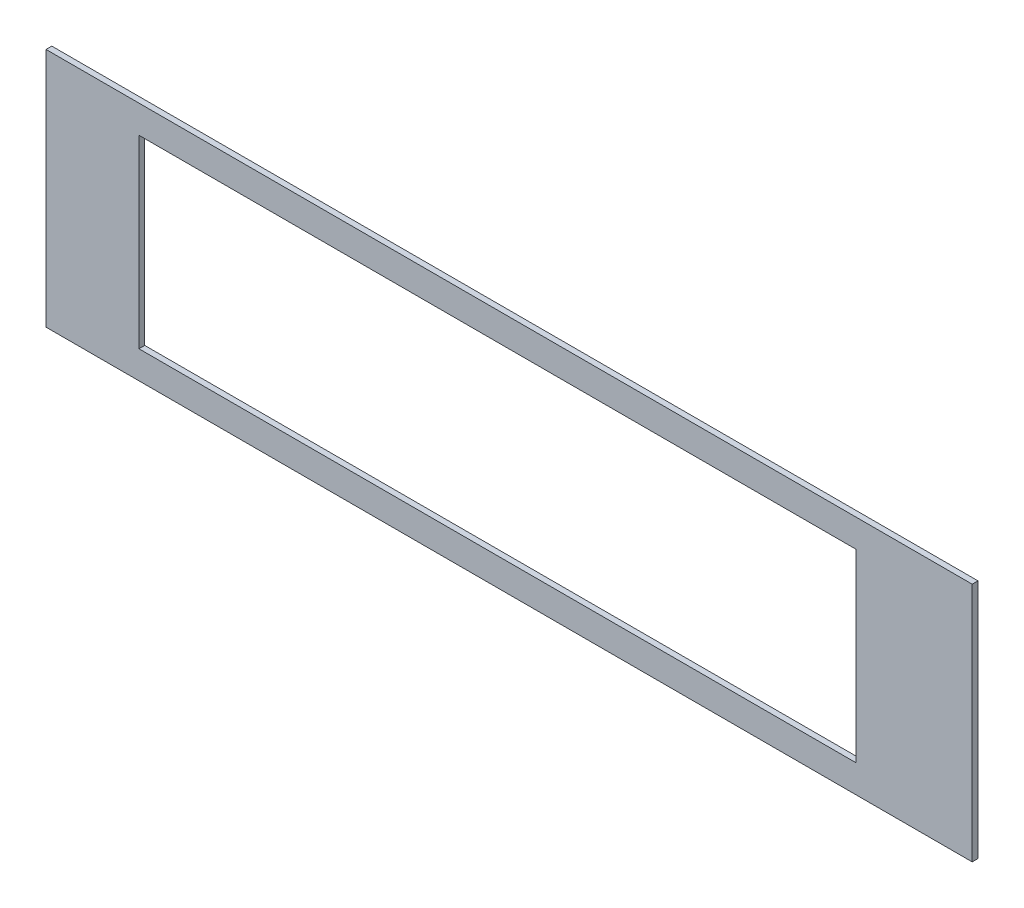
ISO-10303-21;
HEADER;
FILE_DESCRIPTION(('STEP AP214'),'2;1');
FILE_NAME('part.step','',(''),(''),'','','');
FILE_SCHEMA(('AUTOMOTIVE_DESIGN { 1 0 10303 214 1 1 1 1 }'));
ENDSEC;
DATA;
#1=APPLICATION_CONTEXT('core data for automotive mechanical design processes');
#2=APPLICATION_PROTOCOL_DEFINITION('international standard','automotive_design',2000,#1);
#3=PRODUCT_CONTEXT('',#1,'mechanical');
#4=PRODUCT('Part','Part','',(#3));
#5=PRODUCT_RELATED_PRODUCT_CATEGORY('part','',(#4));
#6=PRODUCT_DEFINITION_FORMATION('','',#4);
#7=PRODUCT_DEFINITION_CONTEXT('part definition',#1,'design');
#8=PRODUCT_DEFINITION('design','',#6,#7);
#9=PRODUCT_DEFINITION_SHAPE('','',#8);
#10=(LENGTH_UNIT() NAMED_UNIT(*) SI_UNIT(.MILLI.,.METRE.));
#11=(NAMED_UNIT(*) PLANE_ANGLE_UNIT() SI_UNIT($,.RADIAN.));
#12=(NAMED_UNIT(*) SI_UNIT($,.STERADIAN.) SOLID_ANGLE_UNIT());
#13=UNCERTAINTY_MEASURE_WITH_UNIT(LENGTH_MEASURE(1.E-05),#10,'distance_accuracy_value','');
#14=(GEOMETRIC_REPRESENTATION_CONTEXT(3) GLOBAL_UNCERTAINTY_ASSIGNED_CONTEXT((#13)) GLOBAL_UNIT_ASSIGNED_CONTEXT((#10,
#11,#12)) REPRESENTATION_CONTEXT('',''));
#15=CARTESIAN_POINT('',(0.,0.,0.));
#16=DIRECTION('',(0.,0.,1.));
#17=DIRECTION('',(1.,0.,0.));
#18=AXIS2_PLACEMENT_3D('',#15,#16,#17);
#19=CARTESIAN_POINT('',(0.,0.,3.175));
#20=DIRECTION('',(0.,0.,1.));
#21=DIRECTION('',(1.,0.,0.));
#22=AXIS2_PLACEMENT_3D('',#19,#20,#21);
#23=PLANE('',#22);
#24=DIRECTION('',(0.,-1.,0.));
#25=VECTOR('',#24,1.);
#26=CARTESIAN_POINT('',(-254.1016,65.986025,3.175));
#27=LINE('',#26,#25);
#28=CARTESIAN_POINT('',(-254.1016,65.986025,3.175));
#29=VERTEX_POINT('',#28);
#30=CARTESIAN_POINT('',(-254.1016,-65.986025,3.175));
#31=VERTEX_POINT('',#30);
#32=EDGE_CURVE('E153',#29,#31,#27,.T.);
#33=ORIENTED_EDGE('',*,*,#32,.T.);
#34=DIRECTION('',(1.,0.,0.));
#35=VECTOR('',#34,1.);
#36=CARTESIAN_POINT('',(-254.1016,-65.986025,3.175));
#37=LINE('',#36,#35);
#38=CARTESIAN_POINT('',(254.1016,-65.986025,3.175));
#39=VERTEX_POINT('',#38);
#40=EDGE_CURVE('E157',#31,#39,#37,.T.);
#41=ORIENTED_EDGE('',*,*,#40,.T.);
#42=DIRECTION('',(0.,1.,0.));
#43=VECTOR('',#42,1.);
#44=CARTESIAN_POINT('',(254.1016,-65.986025,3.175));
#45=LINE('',#44,#43);
#46=CARTESIAN_POINT('',(254.1016,65.986025,3.175));
#47=VERTEX_POINT('',#46);
#48=EDGE_CURVE('E161',#39,#47,#45,.T.);
#49=ORIENTED_EDGE('',*,*,#48,.T.);
#50=DIRECTION('',(-1.,0.,0.));
#51=VECTOR('',#50,1.);
#52=CARTESIAN_POINT('',(254.1016,65.986025,3.175));
#53=LINE('',#52,#51);
#54=EDGE_CURVE('E164',#47,#29,#53,.T.);
#55=ORIENTED_EDGE('',*,*,#54,.T.);
#56=EDGE_LOOP('',(#33,#41,#49,#55));
#57=FACE_BOUND('',#56,.T.);
#58=DIRECTION('',(1.,0.,0.));
#59=VECTOR('',#58,1.);
#60=CARTESIAN_POINT('',(-203.0984,-50.7492,3.175));
#61=LINE('',#60,#59);
#62=CARTESIAN_POINT('',(-203.0984,-50.7492,3.175));
#63=VERTEX_POINT('',#62);
#64=CARTESIAN_POINT('',(190.3984,-50.7492,3.175));
#65=VERTEX_POINT('',#64);
#66=EDGE_CURVE('E114',#63,#65,#61,.T.);
#67=ORIENTED_EDGE('',*,*,#66,.F.);
#68=DIRECTION('',(0.,-1.,0.));
#69=VECTOR('',#68,1.);
#70=CARTESIAN_POINT('',(-203.0984,50.6984,3.175));
#71=LINE('',#70,#69);
#72=CARTESIAN_POINT('',(-203.0984,50.6984,3.175));
#73=VERTEX_POINT('',#72);
#74=EDGE_CURVE('E105',#73,#63,#71,.T.);
#75=ORIENTED_EDGE('',*,*,#74,.F.);
#76=DIRECTION('',(-1.,0.,0.));
#77=VECTOR('',#76,1.);
#78=CARTESIAN_POINT('',(190.3984,50.6984,3.175));
#79=LINE('',#78,#77);
#80=CARTESIAN_POINT('',(190.3984,50.6984,3.175));
#81=VERTEX_POINT('',#80);
#82=EDGE_CURVE('E131',#81,#73,#79,.T.);
#83=ORIENTED_EDGE('',*,*,#82,.F.);
#84=DIRECTION('',(0.,1.,0.));
#85=VECTOR('',#84,1.);
#86=CARTESIAN_POINT('',(190.3984,-50.7492,3.175));
#87=LINE('',#86,#85);
#88=EDGE_CURVE('E127',#65,#81,#87,.T.);
#89=ORIENTED_EDGE('',*,*,#88,.F.);
#90=EDGE_LOOP('',(#67,#75,#83,#89));
#91=FACE_BOUND('',#90,.T.);
#92=ADVANCED_FACE('F39',(#57,#91),#23,.T.);
#93=CARTESIAN_POINT('',(0.,0.,0.));
#94=DIRECTION('',(0.,0.,1.));
#95=DIRECTION('',(1.,0.,0.));
#96=AXIS2_PLACEMENT_3D('',#93,#94,#95);
#97=PLANE('',#96);
#98=DIRECTION('',(0.,-1.,0.));
#99=VECTOR('',#98,1.);
#100=CARTESIAN_POINT('',(-254.1016,65.986025,0.));
#101=LINE('',#100,#99);
#102=CARTESIAN_POINT('',(-254.1016,65.986025,0.));
#103=VERTEX_POINT('',#102);
#104=CARTESIAN_POINT('',(-254.1016,-65.986025,0.));
#105=VERTEX_POINT('',#104);
#106=EDGE_CURVE('E123',#103,#105,#101,.T.);
#107=ORIENTED_EDGE('',*,*,#106,.F.);
#108=DIRECTION('',(-1.,0.,0.));
#109=VECTOR('',#108,1.);
#110=CARTESIAN_POINT('',(254.1016,65.986025,0.));
#111=LINE('',#110,#109);
#112=CARTESIAN_POINT('',(254.1016,65.986025,0.));
#113=VERTEX_POINT('',#112);
#114=EDGE_CURVE('E158',#113,#103,#111,.T.);
#115=ORIENTED_EDGE('',*,*,#114,.F.);
#116=DIRECTION('',(0.,1.,0.));
#117=VECTOR('',#116,1.);
#118=CARTESIAN_POINT('',(254.1016,-65.986025,0.));
#119=LINE('',#118,#117);
#120=CARTESIAN_POINT('',(254.1016,-65.986025,0.));
#121=VERTEX_POINT('',#120);
#122=EDGE_CURVE('E174',#121,#113,#119,.T.);
#123=ORIENTED_EDGE('',*,*,#122,.F.);
#124=DIRECTION('',(1.,0.,0.));
#125=VECTOR('',#124,1.);
#126=CARTESIAN_POINT('',(-254.1016,-65.986025,0.));
#127=LINE('',#126,#125);
#128=EDGE_CURVE('E171',#105,#121,#127,.T.);
#129=ORIENTED_EDGE('',*,*,#128,.F.);
#130=EDGE_LOOP('',(#107,#115,#123,#129));
#131=FACE_BOUND('',#130,.T.);
#132=DIRECTION('',(0.,-1.,0.));
#133=VECTOR('',#132,1.);
#134=CARTESIAN_POINT('',(-203.0984,50.6984,0.));
#135=LINE('',#134,#133);
#136=CARTESIAN_POINT('',(-203.0984,50.6984,0.));
#137=VERTEX_POINT('',#136);
#138=CARTESIAN_POINT('',(-203.0984,-50.7492,0.));
#139=VERTEX_POINT('',#138);
#140=EDGE_CURVE('E63',#137,#139,#135,.T.);
#141=ORIENTED_EDGE('',*,*,#140,.T.);
#142=DIRECTION('',(1.,0.,0.));
#143=VECTOR('',#142,1.);
#144=CARTESIAN_POINT('',(-203.0984,-50.7492,0.));
#145=LINE('',#144,#143);
#146=CARTESIAN_POINT('',(190.3984,-50.7492,0.));
#147=VERTEX_POINT('',#146);
#148=EDGE_CURVE('E121',#139,#147,#145,.T.);
#149=ORIENTED_EDGE('',*,*,#148,.T.);
#150=DIRECTION('',(0.,1.,0.));
#151=VECTOR('',#150,1.);
#152=CARTESIAN_POINT('',(190.3984,-50.7492,0.));
#153=LINE('',#152,#151);
#154=CARTESIAN_POINT('',(190.3984,50.6984,0.));
#155=VERTEX_POINT('',#154);
#156=EDGE_CURVE('E140',#147,#155,#153,.T.);
#157=ORIENTED_EDGE('',*,*,#156,.T.);
#158=DIRECTION('',(-1.,0.,0.));
#159=VECTOR('',#158,1.);
#160=CARTESIAN_POINT('',(190.3984,50.6984,0.));
#161=LINE('',#160,#159);
#162=EDGE_CURVE('E115',#155,#137,#161,.T.);
#163=ORIENTED_EDGE('',*,*,#162,.T.);
#164=EDGE_LOOP('',(#141,#149,#157,#163));
#165=FACE_BOUND('',#164,.T.);
#166=ADVANCED_FACE('F197',(#131,#165),#97,.F.);
#167=CARTESIAN_POINT('',(-254.1016,65.986025,3.175));
#168=DIRECTION('',(1.,0.,0.));
#169=DIRECTION('',(0.,0.,-1.));
#170=AXIS2_PLACEMENT_3D('',#167,#168,#169);
#171=PLANE('',#170);
#172=ORIENTED_EDGE('',*,*,#106,.T.);
#173=DIRECTION('',(0.,0.,-1.));
#174=VECTOR('',#173,1.);
#175=CARTESIAN_POINT('',(-254.1016,-65.986025,3.175));
#176=LINE('',#175,#174);
#177=EDGE_CURVE('E11',#31,#105,#176,.T.);
#178=ORIENTED_EDGE('',*,*,#177,.F.);
#179=ORIENTED_EDGE('',*,*,#32,.F.);
#180=DIRECTION('',(0.,0.,-1.));
#181=VECTOR('',#180,1.);
#182=CARTESIAN_POINT('',(-254.1016,65.986025,3.175));
#183=LINE('',#182,#181);
#184=EDGE_CURVE('E167',#29,#103,#183,.T.);
#185=ORIENTED_EDGE('',*,*,#184,.T.);
#186=EDGE_LOOP('',(#172,#178,#179,#185));
#187=FACE_BOUND('',#186,.T.);
#188=ADVANCED_FACE('F41',(#187),#171,.F.);
#189=CARTESIAN_POINT('',(-254.1016,-65.986025,3.175));
#190=DIRECTION('',(0.,1.,0.));
#191=DIRECTION('',(0.,0.,1.));
#192=AXIS2_PLACEMENT_3D('',#189,#190,#191);
#193=PLANE('',#192);
#194=ORIENTED_EDGE('',*,*,#128,.T.);
#195=DIRECTION('',(0.,0.,-1.));
#196=VECTOR('',#195,1.);
#197=CARTESIAN_POINT('',(254.1016,-65.986025,3.175));
#198=LINE('',#197,#196);
#199=EDGE_CURVE('E48',#39,#121,#198,.T.);
#200=ORIENTED_EDGE('',*,*,#199,.F.);
#201=ORIENTED_EDGE('',*,*,#40,.F.);
#202=ORIENTED_EDGE('',*,*,#177,.T.);
#203=EDGE_LOOP('',(#194,#200,#201,#202));
#204=FACE_BOUND('',#203,.T.);
#205=ADVANCED_FACE('F207',(#204),#193,.F.);
#206=CARTESIAN_POINT('',(254.1016,-65.986025,3.175));
#207=DIRECTION('',(-1.,0.,0.));
#208=DIRECTION('',(0.,0.,1.));
#209=AXIS2_PLACEMENT_3D('',#206,#207,#208);
#210=PLANE('',#209);
#211=ORIENTED_EDGE('',*,*,#122,.T.);
#212=DIRECTION('',(0.,0.,-1.));
#213=VECTOR('',#212,1.);
#214=CARTESIAN_POINT('',(254.1016,65.986025,3.175));
#215=LINE('',#214,#213);
#216=EDGE_CURVE('E182',#47,#113,#215,.T.);
#217=ORIENTED_EDGE('',*,*,#216,.F.);
#218=ORIENTED_EDGE('',*,*,#48,.F.);
#219=ORIENTED_EDGE('',*,*,#199,.T.);
#220=EDGE_LOOP('',(#211,#217,#218,#219));
#221=FACE_BOUND('',#220,.T.);
#222=ADVANCED_FACE('F191',(#221),#210,.F.);
#223=CARTESIAN_POINT('',(254.1016,65.986025,3.175));
#224=DIRECTION('',(0.,-1.,0.));
#225=DIRECTION('',(0.,0.,-1.));
#226=AXIS2_PLACEMENT_3D('',#223,#224,#225);
#227=PLANE('',#226);
#228=ORIENTED_EDGE('',*,*,#114,.T.);
#229=ORIENTED_EDGE('',*,*,#184,.F.);
#230=ORIENTED_EDGE('',*,*,#54,.F.);
#231=ORIENTED_EDGE('',*,*,#216,.T.);
#232=EDGE_LOOP('',(#228,#229,#230,#231));
#233=FACE_BOUND('',#232,.T.);
#234=ADVANCED_FACE('F201',(#233),#227,.F.);
#235=CARTESIAN_POINT('',(-203.0984,50.6984,3.175));
#236=DIRECTION('',(1.,0.,0.));
#237=DIRECTION('',(0.,0.,-1.));
#238=AXIS2_PLACEMENT_3D('',#235,#236,#237);
#239=PLANE('',#238);
#240=ORIENTED_EDGE('',*,*,#140,.F.);
#241=DIRECTION('',(0.,0.,-1.));
#242=VECTOR('',#241,1.);
#243=CARTESIAN_POINT('',(-203.0984,50.6984,3.175));
#244=LINE('',#243,#242);
#245=EDGE_CURVE('E109',#73,#137,#244,.T.);
#246=ORIENTED_EDGE('',*,*,#245,.F.);
#247=ORIENTED_EDGE('',*,*,#74,.T.);
#248=DIRECTION('',(0.,0.,-1.));
#249=VECTOR('',#248,1.);
#250=CARTESIAN_POINT('',(-203.0984,-50.7492,3.175));
#251=LINE('',#250,#249);
#252=EDGE_CURVE('E108',#63,#139,#251,.T.);
#253=ORIENTED_EDGE('',*,*,#252,.T.);
#254=EDGE_LOOP('',(#240,#246,#247,#253));
#255=FACE_BOUND('',#254,.T.);
#256=ADVANCED_FACE('F107',(#255),#239,.T.);
#257=CARTESIAN_POINT('',(-203.0984,-50.7492,3.175));
#258=DIRECTION('',(0.,1.,0.));
#259=DIRECTION('',(0.,0.,1.));
#260=AXIS2_PLACEMENT_3D('',#257,#258,#259);
#261=PLANE('',#260);
#262=ORIENTED_EDGE('',*,*,#148,.F.);
#263=ORIENTED_EDGE('',*,*,#252,.F.);
#264=ORIENTED_EDGE('',*,*,#66,.T.);
#265=DIRECTION('',(0.,0.,-1.));
#266=VECTOR('',#265,1.);
#267=CARTESIAN_POINT('',(190.3984,-50.7492,3.175));
#268=LINE('',#267,#266);
#269=EDGE_CURVE('E124',#65,#147,#268,.T.);
#270=ORIENTED_EDGE('',*,*,#269,.T.);
#271=EDGE_LOOP('',(#262,#263,#264,#270));
#272=FACE_BOUND('',#271,.T.);
#273=ADVANCED_FACE('F118',(#272),#261,.T.);
#274=CARTESIAN_POINT('',(190.3984,-50.7492,3.175));
#275=DIRECTION('',(-1.,0.,0.));
#276=DIRECTION('',(0.,0.,1.));
#277=AXIS2_PLACEMENT_3D('',#274,#275,#276);
#278=PLANE('',#277);
#279=ORIENTED_EDGE('',*,*,#156,.F.);
#280=ORIENTED_EDGE('',*,*,#269,.F.);
#281=ORIENTED_EDGE('',*,*,#88,.T.);
#282=DIRECTION('',(0.,0.,-1.));
#283=VECTOR('',#282,1.);
#284=CARTESIAN_POINT('',(190.3984,50.6984,3.175));
#285=LINE('',#284,#283);
#286=EDGE_CURVE('E55',#81,#155,#285,.T.);
#287=ORIENTED_EDGE('',*,*,#286,.T.);
#288=EDGE_LOOP('',(#279,#280,#281,#287));
#289=FACE_BOUND('',#288,.T.);
#290=ADVANCED_FACE('F230',(#289),#278,.T.);
#291=CARTESIAN_POINT('',(190.3984,50.6984,3.175));
#292=DIRECTION('',(0.,-1.,0.));
#293=DIRECTION('',(0.,0.,-1.));
#294=AXIS2_PLACEMENT_3D('',#291,#292,#293);
#295=PLANE('',#294);
#296=ORIENTED_EDGE('',*,*,#162,.F.);
#297=ORIENTED_EDGE('',*,*,#286,.F.);
#298=ORIENTED_EDGE('',*,*,#82,.T.);
#299=ORIENTED_EDGE('',*,*,#245,.T.);
#300=EDGE_LOOP('',(#296,#297,#298,#299));
#301=FACE_BOUND('',#300,.T.);
#302=ADVANCED_FACE('F234',(#301),#295,.T.);
#303=CLOSED_SHELL('',(#92,#166,#188,#205,#222,#234,#256,#273,#290,#302));
#304=MANIFOLD_SOLID_BREP('B2',#303);
#305=ADVANCED_BREP_SHAPE_REPRESENTATION('',(#18,#304),#14);
#306=SHAPE_DEFINITION_REPRESENTATION(#9,#305);
ENDSEC;
END-ISO-10303-21;
